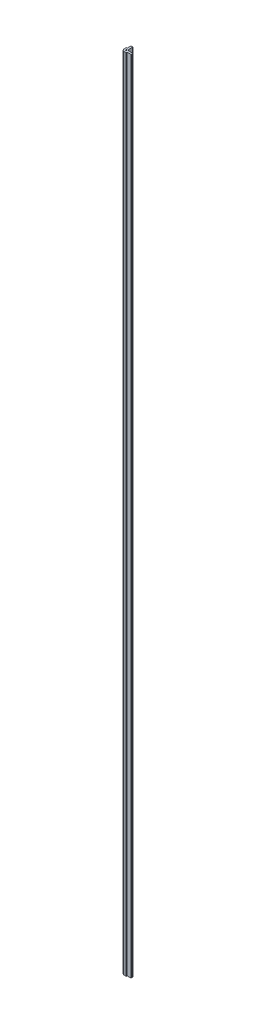
ISO-10303-21;
HEADER;
FILE_DESCRIPTION(('STEP AP214'),'2;1');
FILE_NAME('part.step','',(''),(''),'','','');
FILE_SCHEMA(('AUTOMOTIVE_DESIGN { 1 0 10303 214 1 1 1 1 }'));
ENDSEC;
DATA;
#1=APPLICATION_CONTEXT('core data for automotive mechanical design processes');
#2=APPLICATION_PROTOCOL_DEFINITION('international standard','automotive_design',2000,#1);
#3=PRODUCT_CONTEXT('',#1,'mechanical');
#4=PRODUCT('Part','Part','',(#3));
#5=PRODUCT_RELATED_PRODUCT_CATEGORY('part','',(#4));
#6=PRODUCT_DEFINITION_FORMATION('','',#4);
#7=PRODUCT_DEFINITION_CONTEXT('part definition',#1,'design');
#8=PRODUCT_DEFINITION('design','',#6,#7);
#9=PRODUCT_DEFINITION_SHAPE('','',#8);
#10=(LENGTH_UNIT() NAMED_UNIT(*) SI_UNIT(.MILLI.,.METRE.));
#11=(NAMED_UNIT(*) PLANE_ANGLE_UNIT() SI_UNIT($,.RADIAN.));
#12=(NAMED_UNIT(*) SI_UNIT($,.STERADIAN.) SOLID_ANGLE_UNIT());
#13=UNCERTAINTY_MEASURE_WITH_UNIT(LENGTH_MEASURE(1.E-05),#10,'distance_accuracy_value','');
#14=(GEOMETRIC_REPRESENTATION_CONTEXT(3) GLOBAL_UNCERTAINTY_ASSIGNED_CONTEXT((#13)) GLOBAL_UNIT_ASSIGNED_CONTEXT((#10,
#11,#12)) REPRESENTATION_CONTEXT('',''));
#15=CARTESIAN_POINT('',(0.,0.,0.));
#16=DIRECTION('',(0.,0.,1.));
#17=DIRECTION('',(1.,0.,0.));
#18=AXIS2_PLACEMENT_3D('',#15,#16,#17);
#19=CARTESIAN_POINT('',(0.508,1828.8,-13.208));
#20=DIRECTION('',(0.,-1.,0.));
#21=DIRECTION('',(0.,0.,-1.));
#22=AXIS2_PLACEMENT_3D('',#19,#20,#21);
#23=CYLINDRICAL_SURFACE('',#22,0.762000000000001);
#24=CARTESIAN_POINT('',(0.508,0.,-13.208));
#25=DIRECTION('',(0.,1.,0.));
#26=DIRECTION('',(0.,0.,1.));
#27=AXIS2_PLACEMENT_3D('',#24,#25,#26);
#28=CIRCLE('',#27,0.762000000000001);
#29=CARTESIAN_POINT('',(1.27,0.,-13.208));
#30=VERTEX_POINT('',#29);
#31=CARTESIAN_POINT('',(0.508,0.,-13.97));
#32=VERTEX_POINT('',#31);
#33=EDGE_CURVE('E215',#30,#32,#28,.T.);
#34=ORIENTED_EDGE('',*,*,#33,.T.);
#35=DIRECTION('',(0.,-1.,0.));
#36=VECTOR('',#35,1.);
#37=CARTESIAN_POINT('',(0.508,1828.8,-13.97));
#38=LINE('',#37,#36);
#39=CARTESIAN_POINT('',(0.508,1828.8,-13.97));
#40=VERTEX_POINT('',#39);
#41=EDGE_CURVE('E11',#40,#32,#38,.T.);
#42=ORIENTED_EDGE('',*,*,#41,.F.);
#43=CARTESIAN_POINT('',(0.508,1828.8,-13.208));
#44=DIRECTION('',(0.,1.,0.));
#45=DIRECTION('',(0.,0.,1.));
#46=AXIS2_PLACEMENT_3D('',#43,#44,#45);
#47=CIRCLE('',#46,0.762000000000001);
#48=CARTESIAN_POINT('',(1.27,1828.8,-13.208));
#49=VERTEX_POINT('',#48);
#50=EDGE_CURVE('E258',#49,#40,#47,.T.);
#51=ORIENTED_EDGE('',*,*,#50,.F.);
#52=DIRECTION('',(0.,-1.,0.));
#53=VECTOR('',#52,1.);
#54=CARTESIAN_POINT('',(1.27,1828.8,-13.208));
#55=LINE('',#54,#53);
#56=EDGE_CURVE('E211',#49,#30,#55,.T.);
#57=ORIENTED_EDGE('',*,*,#56,.T.);
#58=EDGE_LOOP('',(#34,#42,#51,#57));
#59=FACE_BOUND('',#58,.T.);
#60=ADVANCED_FACE('F35',(#59),#23,.T.);
#61=CARTESIAN_POINT('',(-2.286,1828.8,-13.97));
#62=DIRECTION('',(0.,0.,1.));
#63=DIRECTION('',(1.,0.,0.));
#64=AXIS2_PLACEMENT_3D('',#61,#62,#63);
#65=PLANE('',#64);
#66=DIRECTION('',(-1.,0.,0.));
#67=VECTOR('',#66,1.);
#68=CARTESIAN_POINT('',(-2.286,0.,-13.97));
#69=LINE('',#68,#67);
#70=CARTESIAN_POINT('',(-2.286,0.,-13.97));
#71=VERTEX_POINT('',#70);
#72=EDGE_CURVE('E218',#32,#71,#69,.T.);
#73=ORIENTED_EDGE('',*,*,#72,.T.);
#74=DIRECTION('',(0.,-1.,0.));
#75=VECTOR('',#74,1.);
#76=CARTESIAN_POINT('',(-2.286,1828.8,-13.97));
#77=LINE('',#76,#75);
#78=CARTESIAN_POINT('',(-2.286,1828.8,-13.97));
#79=VERTEX_POINT('',#78);
#80=EDGE_CURVE('E43',#79,#71,#77,.T.);
#81=ORIENTED_EDGE('',*,*,#80,.F.);
#82=DIRECTION('',(-1.,0.,0.));
#83=VECTOR('',#82,1.);
#84=CARTESIAN_POINT('',(-2.286,1828.8,-13.97));
#85=LINE('',#84,#83);
#86=EDGE_CURVE('E136',#40,#79,#85,.T.);
#87=ORIENTED_EDGE('',*,*,#86,.F.);
#88=ORIENTED_EDGE('',*,*,#41,.T.);
#89=EDGE_LOOP('',(#73,#81,#87,#88));
#90=FACE_BOUND('',#89,.T.);
#91=ADVANCED_FACE('F387',(#90),#65,.F.);
#92=CARTESIAN_POINT('',(-2.286,1828.8,-13.208));
#93=DIRECTION('',(0.,-1.,0.));
#94=DIRECTION('',(0.,0.,-1.));
#95=AXIS2_PLACEMENT_3D('',#92,#93,#94);
#96=CYLINDRICAL_SURFACE('',#95,0.762000000000001);
#97=CARTESIAN_POINT('',(-2.286,0.,-13.208));
#98=DIRECTION('',(0.,1.,0.));
#99=DIRECTION('',(0.,0.,-1.));
#100=AXIS2_PLACEMENT_3D('',#97,#98,#99);
#101=CIRCLE('',#100,0.762000000000001);
#102=CARTESIAN_POINT('',(-3.048,0.,-13.208));
#103=VERTEX_POINT('',#102);
#104=EDGE_CURVE('E221',#71,#103,#101,.T.);
#105=ORIENTED_EDGE('',*,*,#104,.T.);
#106=DIRECTION('',(0.,-1.,0.));
#107=VECTOR('',#106,1.);
#108=CARTESIAN_POINT('',(-3.048,1828.8,-13.208));
#109=LINE('',#108,#107);
#110=CARTESIAN_POINT('',(-3.048,1828.8,-13.208));
#111=VERTEX_POINT('',#110);
#112=EDGE_CURVE('E307',#111,#103,#109,.T.);
#113=ORIENTED_EDGE('',*,*,#112,.F.);
#114=CARTESIAN_POINT('',(-2.286,1828.8,-13.208));
#115=DIRECTION('',(0.,1.,0.));
#116=DIRECTION('',(0.,0.,-1.));
#117=AXIS2_PLACEMENT_3D('',#114,#115,#116);
#118=CIRCLE('',#117,0.762000000000001);
#119=EDGE_CURVE('E315',#79,#111,#118,.T.);
#120=ORIENTED_EDGE('',*,*,#119,.F.);
#121=ORIENTED_EDGE('',*,*,#80,.T.);
#122=EDGE_LOOP('',(#105,#113,#120,#121));
#123=FACE_BOUND('',#122,.T.);
#124=ADVANCED_FACE('F313',(#123),#96,.T.);
#125=CARTESIAN_POINT('',(-3.048,1828.8,-13.208));
#126=DIRECTION('',(1.,0.,0.));
#127=DIRECTION('',(0.,0.,-1.));
#128=AXIS2_PLACEMENT_3D('',#125,#126,#127);
#129=PLANE('',#128);
#130=DIRECTION('',(0.,0.,1.));
#131=VECTOR('',#130,1.);
#132=CARTESIAN_POINT('',(-3.048,0.,-13.208));
#133=LINE('',#132,#131);
#134=CARTESIAN_POINT('',(-3.048,0.,-4.953));
#135=VERTEX_POINT('',#134);
#136=EDGE_CURVE('E223',#103,#135,#133,.T.);
#137=ORIENTED_EDGE('',*,*,#136,.T.);
#138=DIRECTION('',(0.,-1.,0.));
#139=VECTOR('',#138,1.);
#140=CARTESIAN_POINT('',(-3.048,1828.8,-4.953));
#141=LINE('',#140,#139);
#142=CARTESIAN_POINT('',(-3.048,1828.8,-4.953));
#143=VERTEX_POINT('',#142);
#144=EDGE_CURVE('E304',#143,#135,#141,.T.);
#145=ORIENTED_EDGE('',*,*,#144,.F.);
#146=DIRECTION('',(0.,0.,1.));
#147=VECTOR('',#146,1.);
#148=CARTESIAN_POINT('',(-3.048,1828.8,-13.208));
#149=LINE('',#148,#147);
#150=EDGE_CURVE('E333',#111,#143,#149,.T.);
#151=ORIENTED_EDGE('',*,*,#150,.F.);
#152=ORIENTED_EDGE('',*,*,#112,.T.);
#153=EDGE_LOOP('',(#137,#145,#151,#152));
#154=FACE_BOUND('',#153,.T.);
#155=ADVANCED_FACE('F324',(#154),#129,.F.);
#156=CARTESIAN_POINT('',(-3.175,1828.8,-4.953));
#157=DIRECTION('',(0.,-1.,0.));
#158=DIRECTION('',(0.,0.,-1.));
#159=AXIS2_PLACEMENT_3D('',#156,#157,#158);
#160=CYLINDRICAL_SURFACE('',#159,0.127);
#161=CARTESIAN_POINT('',(-3.175,0.,-4.953));
#162=DIRECTION('',(0.,-1.,0.));
#163=DIRECTION('',(0.,0.,-1.));
#164=AXIS2_PLACEMENT_3D('',#161,#162,#163);
#165=CIRCLE('',#164,0.127);
#166=CARTESIAN_POINT('',(-3.175,0.,-4.826));
#167=VERTEX_POINT('',#166);
#168=EDGE_CURVE('E225',#135,#167,#165,.T.);
#169=ORIENTED_EDGE('',*,*,#168,.T.);
#170=DIRECTION('',(0.,-1.,0.));
#171=VECTOR('',#170,1.);
#172=CARTESIAN_POINT('',(-3.175,1828.8,-4.826));
#173=LINE('',#172,#171);
#174=CARTESIAN_POINT('',(-3.175,1828.8,-4.826));
#175=VERTEX_POINT('',#174);
#176=EDGE_CURVE('E301',#175,#167,#173,.T.);
#177=ORIENTED_EDGE('',*,*,#176,.F.);
#178=CARTESIAN_POINT('',(-3.175,1828.8,-4.953));
#179=DIRECTION('',(0.,-1.,0.));
#180=DIRECTION('',(0.,0.,-1.));
#181=AXIS2_PLACEMENT_3D('',#178,#179,#180);
#182=CIRCLE('',#181,0.127);
#183=EDGE_CURVE('E330',#143,#175,#182,.T.);
#184=ORIENTED_EDGE('',*,*,#183,.F.);
#185=ORIENTED_EDGE('',*,*,#144,.T.);
#186=EDGE_LOOP('',(#169,#177,#184,#185));
#187=FACE_BOUND('',#186,.T.);
#188=ADVANCED_FACE('F328',(#187),#160,.F.);
#189=CARTESIAN_POINT('',(-3.175,1828.8,-4.826));
#190=DIRECTION('',(0.,0.,1.));
#191=DIRECTION('',(1.,0.,0.));
#192=AXIS2_PLACEMENT_3D('',#189,#190,#191);
#193=PLANE('',#192);
#194=DIRECTION('',(-1.,0.,0.));
#195=VECTOR('',#194,1.);
#196=CARTESIAN_POINT('',(-3.175,0.,-4.826));
#197=LINE('',#196,#195);
#198=CARTESIAN_POINT('',(-4.826,0.,-4.826));
#199=VERTEX_POINT('',#198);
#200=EDGE_CURVE('E227',#167,#199,#197,.T.);
#201=ORIENTED_EDGE('',*,*,#200,.T.);
#202=DIRECTION('',(0.,-1.,0.));
#203=VECTOR('',#202,1.);
#204=CARTESIAN_POINT('',(-4.826,1828.8,-4.826));
#205=LINE('',#204,#203);
#206=CARTESIAN_POINT('',(-4.826,1828.8,-4.826));
#207=VERTEX_POINT('',#206);
#208=EDGE_CURVE('E298',#207,#199,#205,.T.);
#209=ORIENTED_EDGE('',*,*,#208,.F.);
#210=DIRECTION('',(-1.,0.,0.));
#211=VECTOR('',#210,1.);
#212=CARTESIAN_POINT('',(-3.175,1828.8,-4.826));
#213=LINE('',#212,#211);
#214=EDGE_CURVE('E332',#175,#207,#213,.T.);
#215=ORIENTED_EDGE('',*,*,#214,.F.);
#216=ORIENTED_EDGE('',*,*,#176,.T.);
#217=EDGE_LOOP('',(#201,#209,#215,#216));
#218=FACE_BOUND('',#217,.T.);
#219=ADVANCED_FACE('F400',(#218),#193,.F.);
#220=CARTESIAN_POINT('',(-4.826,1828.8,-4.572));
#221=DIRECTION('',(0.,-1.,0.));
#222=DIRECTION('',(0.,0.,-1.));
#223=AXIS2_PLACEMENT_3D('',#220,#221,#222);
#224=CYLINDRICAL_SURFACE('',#223,0.253999999999999);
#225=CARTESIAN_POINT('',(-4.826,0.,-4.572));
#226=DIRECTION('',(0.,1.,0.));
#227=DIRECTION('',(0.,0.,1.));
#228=AXIS2_PLACEMENT_3D('',#225,#226,#227);
#229=CIRCLE('',#228,0.253999999999999);
#230=CARTESIAN_POINT('',(-5.08,0.,-4.572));
#231=VERTEX_POINT('',#230);
#232=EDGE_CURVE('E229',#199,#231,#229,.T.);
#233=ORIENTED_EDGE('',*,*,#232,.T.);
#234=DIRECTION('',(0.,-1.,0.));
#235=VECTOR('',#234,1.);
#236=CARTESIAN_POINT('',(-5.08,1828.8,-4.572));
#237=LINE('',#236,#235);
#238=CARTESIAN_POINT('',(-5.08,1828.8,-4.572));
#239=VERTEX_POINT('',#238);
#240=EDGE_CURVE('E295',#239,#231,#237,.T.);
#241=ORIENTED_EDGE('',*,*,#240,.F.);
#242=CARTESIAN_POINT('',(-4.826,1828.8,-4.572));
#243=DIRECTION('',(0.,1.,0.));
#244=DIRECTION('',(0.,0.,1.));
#245=AXIS2_PLACEMENT_3D('',#242,#243,#244);
#246=CIRCLE('',#245,0.253999999999999);
#247=EDGE_CURVE('E335',#207,#239,#246,.T.);
#248=ORIENTED_EDGE('',*,*,#247,.F.);
#249=ORIENTED_EDGE('',*,*,#208,.T.);
#250=EDGE_LOOP('',(#233,#241,#248,#249));
#251=FACE_BOUND('',#250,.T.);
#252=ADVANCED_FACE('F403',(#251),#224,.T.);
#253=CARTESIAN_POINT('',(-5.08,1828.8,0.));
#254=DIRECTION('',(1.,0.,0.));
#255=DIRECTION('',(0.,0.,-1.));
#256=AXIS2_PLACEMENT_3D('',#253,#254,#255);
#257=PLANE('',#256);
#258=DIRECTION('',(0.,0.,1.));
#259=VECTOR('',#258,1.);
#260=CARTESIAN_POINT('',(-5.08,0.,0.));
#261=LINE('',#260,#259);
#262=CARTESIAN_POINT('',(-5.08,0.,0.));
#263=VERTEX_POINT('',#262);
#264=EDGE_CURVE('E231',#231,#263,#261,.T.);
#265=ORIENTED_EDGE('',*,*,#264,.T.);
#266=DIRECTION('',(0.,-1.,0.));
#267=VECTOR('',#266,1.);
#268=CARTESIAN_POINT('',(-5.08,1828.8,0.));
#269=LINE('',#268,#267);
#270=CARTESIAN_POINT('',(-5.08,1828.8,0.));
#271=VERTEX_POINT('',#270);
#272=EDGE_CURVE('E292',#271,#263,#269,.T.);
#273=ORIENTED_EDGE('',*,*,#272,.F.);
#274=DIRECTION('',(0.,0.,1.));
#275=VECTOR('',#274,1.);
#276=CARTESIAN_POINT('',(-5.08,1828.8,0.));
#277=LINE('',#276,#275);
#278=EDGE_CURVE('E341',#239,#271,#277,.T.);
#279=ORIENTED_EDGE('',*,*,#278,.F.);
#280=ORIENTED_EDGE('',*,*,#240,.T.);
#281=EDGE_LOOP('',(#265,#273,#279,#280));
#282=FACE_BOUND('',#281,.T.);
#283=ADVANCED_FACE('F407',(#282),#257,.F.);
#284=CARTESIAN_POINT('',(0.,1828.8,0.));
#285=DIRECTION('',(0.,-1.,0.));
#286=DIRECTION('',(0.,0.,-1.));
#287=AXIS2_PLACEMENT_3D('',#284,#285,#286);
#288=CYLINDRICAL_SURFACE('',#287,5.08);
#289=CARTESIAN_POINT('',(0.,0.,0.));
#290=DIRECTION('',(0.,1.,0.));
#291=DIRECTION('',(0.,0.,-1.));
#292=AXIS2_PLACEMENT_3D('',#289,#290,#291);
#293=CIRCLE('',#292,5.08);
#294=CARTESIAN_POINT('',(0.,0.,5.08));
#295=VERTEX_POINT('',#294);
#296=EDGE_CURVE('E233',#263,#295,#293,.T.);
#297=ORIENTED_EDGE('',*,*,#296,.T.);
#298=DIRECTION('',(0.,-1.,0.));
#299=VECTOR('',#298,1.);
#300=CARTESIAN_POINT('',(0.,1828.8,5.08));
#301=LINE('',#300,#299);
#302=CARTESIAN_POINT('',(0.,1828.8,5.08));
#303=VERTEX_POINT('',#302);
#304=EDGE_CURVE('E289',#303,#295,#301,.T.);
#305=ORIENTED_EDGE('',*,*,#304,.F.);
#306=CARTESIAN_POINT('',(0.,1828.8,0.));
#307=DIRECTION('',(0.,1.,0.));
#308=DIRECTION('',(0.,0.,-1.));
#309=AXIS2_PLACEMENT_3D('',#306,#307,#308);
#310=CIRCLE('',#309,5.08);
#311=EDGE_CURVE('E343',#271,#303,#310,.T.);
#312=ORIENTED_EDGE('',*,*,#311,.F.);
#313=ORIENTED_EDGE('',*,*,#272,.T.);
#314=EDGE_LOOP('',(#297,#305,#312,#313));
#315=FACE_BOUND('',#314,.T.);
#316=ADVANCED_FACE('F411',(#315),#288,.T.);
#317=CARTESIAN_POINT('',(0.,1828.8,5.08));
#318=DIRECTION('',(0.,0.,-1.));
#319=DIRECTION('',(-1.,0.,0.));
#320=AXIS2_PLACEMENT_3D('',#317,#318,#319);
#321=PLANE('',#320);
#322=DIRECTION('',(1.,0.,0.));
#323=VECTOR('',#322,1.);
#324=CARTESIAN_POINT('',(0.,0.,5.08));
#325=LINE('',#324,#323);
#326=CARTESIAN_POINT('',(4.572,0.,5.08));
#327=VERTEX_POINT('',#326);
#328=EDGE_CURVE('E235',#295,#327,#325,.T.);
#329=ORIENTED_EDGE('',*,*,#328,.T.);
#330=DIRECTION('',(0.,-1.,0.));
#331=VECTOR('',#330,1.);
#332=CARTESIAN_POINT('',(4.572,1828.8,5.08));
#333=LINE('',#332,#331);
#334=CARTESIAN_POINT('',(4.572,1828.8,5.08));
#335=VERTEX_POINT('',#334);
#336=EDGE_CURVE('E286',#335,#327,#333,.T.);
#337=ORIENTED_EDGE('',*,*,#336,.F.);
#338=DIRECTION('',(1.,0.,0.));
#339=VECTOR('',#338,1.);
#340=CARTESIAN_POINT('',(0.,1828.8,5.08));
#341=LINE('',#340,#339);
#342=EDGE_CURVE('E345',#303,#335,#341,.T.);
#343=ORIENTED_EDGE('',*,*,#342,.F.);
#344=ORIENTED_EDGE('',*,*,#304,.T.);
#345=EDGE_LOOP('',(#329,#337,#343,#344));
#346=FACE_BOUND('',#345,.T.);
#347=ADVANCED_FACE('F415',(#346),#321,.F.);
#348=CARTESIAN_POINT('',(4.572,1828.8,4.826));
#349=DIRECTION('',(0.,-1.,0.));
#350=DIRECTION('',(0.,0.,-1.));
#351=AXIS2_PLACEMENT_3D('',#348,#349,#350);
#352=CYLINDRICAL_SURFACE('',#351,0.254);
#353=CARTESIAN_POINT('',(4.572,0.,4.826));
#354=DIRECTION('',(0.,1.,0.));
#355=DIRECTION('',(0.,0.,-1.));
#356=AXIS2_PLACEMENT_3D('',#353,#354,#355);
#357=CIRCLE('',#356,0.254);
#358=CARTESIAN_POINT('',(4.826,0.,4.826));
#359=VERTEX_POINT('',#358);
#360=EDGE_CURVE('E237',#327,#359,#357,.T.);
#361=ORIENTED_EDGE('',*,*,#360,.T.);
#362=DIRECTION('',(0.,-1.,0.));
#363=VECTOR('',#362,1.);
#364=CARTESIAN_POINT('',(4.826,1828.8,4.826));
#365=LINE('',#364,#363);
#366=CARTESIAN_POINT('',(4.826,1828.8,4.826));
#367=VERTEX_POINT('',#366);
#368=EDGE_CURVE('E283',#367,#359,#365,.T.);
#369=ORIENTED_EDGE('',*,*,#368,.F.);
#370=CARTESIAN_POINT('',(4.572,1828.8,4.826));
#371=DIRECTION('',(0.,1.,0.));
#372=DIRECTION('',(0.,0.,-1.));
#373=AXIS2_PLACEMENT_3D('',#370,#371,#372);
#374=CIRCLE('',#373,0.254);
#375=EDGE_CURVE('E347',#335,#367,#374,.T.);
#376=ORIENTED_EDGE('',*,*,#375,.F.);
#377=ORIENTED_EDGE('',*,*,#336,.T.);
#378=EDGE_LOOP('',(#361,#369,#376,#377));
#379=FACE_BOUND('',#378,.T.);
#380=ADVANCED_FACE('F419',(#379),#352,.T.);
#381=CARTESIAN_POINT('',(4.826,1828.8,3.175));
#382=DIRECTION('',(-1.,0.,0.));
#383=DIRECTION('',(0.,0.,1.));
#384=AXIS2_PLACEMENT_3D('',#381,#382,#383);
#385=PLANE('',#384);
#386=DIRECTION('',(0.,0.,-1.));
#387=VECTOR('',#386,1.);
#388=CARTESIAN_POINT('',(4.826,0.,3.175));
#389=LINE('',#388,#387);
#390=CARTESIAN_POINT('',(4.826,0.,3.175));
#391=VERTEX_POINT('',#390);
#392=EDGE_CURVE('E239',#359,#391,#389,.T.);
#393=ORIENTED_EDGE('',*,*,#392,.T.);
#394=DIRECTION('',(0.,-1.,0.));
#395=VECTOR('',#394,1.);
#396=CARTESIAN_POINT('',(4.826,1828.8,3.175));
#397=LINE('',#396,#395);
#398=CARTESIAN_POINT('',(4.826,1828.8,3.175));
#399=VERTEX_POINT('',#398);
#400=EDGE_CURVE('E280',#399,#391,#397,.T.);
#401=ORIENTED_EDGE('',*,*,#400,.F.);
#402=DIRECTION('',(0.,0.,-1.));
#403=VECTOR('',#402,1.);
#404=CARTESIAN_POINT('',(4.826,1828.8,3.175));
#405=LINE('',#404,#403);
#406=EDGE_CURVE('E349',#367,#399,#405,.T.);
#407=ORIENTED_EDGE('',*,*,#406,.F.);
#408=ORIENTED_EDGE('',*,*,#368,.T.);
#409=EDGE_LOOP('',(#393,#401,#407,#408));
#410=FACE_BOUND('',#409,.T.);
#411=ADVANCED_FACE('F423',(#410),#385,.F.);
#412=CARTESIAN_POINT('',(4.953,1828.8,3.175));
#413=DIRECTION('',(0.,-1.,0.));
#414=DIRECTION('',(0.,0.,-1.));
#415=AXIS2_PLACEMENT_3D('',#412,#413,#414);
#416=CYLINDRICAL_SURFACE('',#415,0.127000000000001);
#417=CARTESIAN_POINT('',(4.953,0.,3.175));
#418=DIRECTION('',(0.,-1.,0.));
#419=DIRECTION('',(0.,0.,1.));
#420=AXIS2_PLACEMENT_3D('',#417,#418,#419);
#421=CIRCLE('',#420,0.127000000000001);
#422=CARTESIAN_POINT('',(4.953,0.,3.048));
#423=VERTEX_POINT('',#422);
#424=EDGE_CURVE('E241',#391,#423,#421,.T.);
#425=ORIENTED_EDGE('',*,*,#424,.T.);
#426=DIRECTION('',(0.,-1.,0.));
#427=VECTOR('',#426,1.);
#428=CARTESIAN_POINT('',(4.953,1828.8,3.048));
#429=LINE('',#428,#427);
#430=CARTESIAN_POINT('',(4.953,1828.8,3.048));
#431=VERTEX_POINT('',#430);
#432=EDGE_CURVE('E277',#431,#423,#429,.T.);
#433=ORIENTED_EDGE('',*,*,#432,.F.);
#434=CARTESIAN_POINT('',(4.953,1828.8,3.175));
#435=DIRECTION('',(0.,-1.,0.));
#436=DIRECTION('',(0.,0.,1.));
#437=AXIS2_PLACEMENT_3D('',#434,#435,#436);
#438=CIRCLE('',#437,0.127000000000001);
#439=EDGE_CURVE('E351',#399,#431,#438,.T.);
#440=ORIENTED_EDGE('',*,*,#439,.F.);
#441=ORIENTED_EDGE('',*,*,#400,.T.);
#442=EDGE_LOOP('',(#425,#433,#440,#441));
#443=FACE_BOUND('',#442,.T.);
#444=ADVANCED_FACE('F427',(#443),#416,.F.);
#445=CARTESIAN_POINT('',(13.208,1828.8,3.048));
#446=DIRECTION('',(0.,0.,-1.));
#447=DIRECTION('',(-1.,0.,0.));
#448=AXIS2_PLACEMENT_3D('',#445,#446,#447);
#449=PLANE('',#448);
#450=DIRECTION('',(1.,0.,0.));
#451=VECTOR('',#450,1.);
#452=CARTESIAN_POINT('',(13.208,0.,3.048));
#453=LINE('',#452,#451);
#454=CARTESIAN_POINT('',(13.208,0.,3.048));
#455=VERTEX_POINT('',#454);
#456=EDGE_CURVE('E243',#423,#455,#453,.T.);
#457=ORIENTED_EDGE('',*,*,#456,.T.);
#458=DIRECTION('',(0.,-1.,0.));
#459=VECTOR('',#458,1.);
#460=CARTESIAN_POINT('',(13.208,1828.8,3.048));
#461=LINE('',#460,#459);
#462=CARTESIAN_POINT('',(13.208,1828.8,3.048));
#463=VERTEX_POINT('',#462);
#464=EDGE_CURVE('E274',#463,#455,#461,.T.);
#465=ORIENTED_EDGE('',*,*,#464,.F.);
#466=DIRECTION('',(1.,0.,0.));
#467=VECTOR('',#466,1.);
#468=CARTESIAN_POINT('',(13.208,1828.8,3.048));
#469=LINE('',#468,#467);
#470=EDGE_CURVE('E353',#431,#463,#469,.T.);
#471=ORIENTED_EDGE('',*,*,#470,.F.);
#472=ORIENTED_EDGE('',*,*,#432,.T.);
#473=EDGE_LOOP('',(#457,#465,#471,#472));
#474=FACE_BOUND('',#473,.T.);
#475=ADVANCED_FACE('F431',(#474),#449,.F.);
#476=CARTESIAN_POINT('',(13.208,1828.8,2.286));
#477=DIRECTION('',(0.,-1.,0.));
#478=DIRECTION('',(0.,0.,-1.));
#479=AXIS2_PLACEMENT_3D('',#476,#477,#478);
#480=CYLINDRICAL_SURFACE('',#479,0.762000000000001);
#481=CARTESIAN_POINT('',(13.208,0.,2.286));
#482=DIRECTION('',(0.,1.,0.));
#483=DIRECTION('',(0.,0.,1.));
#484=AXIS2_PLACEMENT_3D('',#481,#482,#483);
#485=CIRCLE('',#484,0.762000000000001);
#486=CARTESIAN_POINT('',(13.97,0.,2.286));
#487=VERTEX_POINT('',#486);
#488=EDGE_CURVE('E245',#455,#487,#485,.T.);
#489=ORIENTED_EDGE('',*,*,#488,.T.);
#490=DIRECTION('',(0.,-1.,0.));
#491=VECTOR('',#490,1.);
#492=CARTESIAN_POINT('',(13.97,1828.8,2.286));
#493=LINE('',#492,#491);
#494=CARTESIAN_POINT('',(13.97,1828.8,2.286));
#495=VERTEX_POINT('',#494);
#496=EDGE_CURVE('E271',#495,#487,#493,.T.);
#497=ORIENTED_EDGE('',*,*,#496,.F.);
#498=CARTESIAN_POINT('',(13.208,1828.8,2.286));
#499=DIRECTION('',(0.,1.,0.));
#500=DIRECTION('',(0.,0.,1.));
#501=AXIS2_PLACEMENT_3D('',#498,#499,#500);
#502=CIRCLE('',#501,0.762000000000001);
#503=EDGE_CURVE('E355',#463,#495,#502,.T.);
#504=ORIENTED_EDGE('',*,*,#503,.F.);
#505=ORIENTED_EDGE('',*,*,#464,.T.);
#506=EDGE_LOOP('',(#489,#497,#504,#505));
#507=FACE_BOUND('',#506,.T.);
#508=ADVANCED_FACE('F435',(#507),#480,.T.);
#509=CARTESIAN_POINT('',(13.97,1828.8,2.286));
#510=DIRECTION('',(-1.,0.,0.));
#511=DIRECTION('',(0.,0.,1.));
#512=AXIS2_PLACEMENT_3D('',#509,#510,#511);
#513=PLANE('',#512);
#514=DIRECTION('',(0.,0.,-1.));
#515=VECTOR('',#514,1.);
#516=CARTESIAN_POINT('',(13.97,0.,2.286));
#517=LINE('',#516,#515);
#518=CARTESIAN_POINT('',(13.97,0.,-0.508000000000001));
#519=VERTEX_POINT('',#518);
#520=EDGE_CURVE('E247',#487,#519,#517,.T.);
#521=ORIENTED_EDGE('',*,*,#520,.T.);
#522=DIRECTION('',(0.,-1.,0.));
#523=VECTOR('',#522,1.);
#524=CARTESIAN_POINT('',(13.97,1828.8,-0.508000000000001));
#525=LINE('',#524,#523);
#526=CARTESIAN_POINT('',(13.97,1828.8,-0.508000000000001));
#527=VERTEX_POINT('',#526);
#528=EDGE_CURVE('E268',#527,#519,#525,.T.);
#529=ORIENTED_EDGE('',*,*,#528,.F.);
#530=DIRECTION('',(0.,0.,-1.));
#531=VECTOR('',#530,1.);
#532=CARTESIAN_POINT('',(13.97,1828.8,2.286));
#533=LINE('',#532,#531);
#534=EDGE_CURVE('E357',#495,#527,#533,.T.);
#535=ORIENTED_EDGE('',*,*,#534,.F.);
#536=ORIENTED_EDGE('',*,*,#496,.T.);
#537=EDGE_LOOP('',(#521,#529,#535,#536));
#538=FACE_BOUND('',#537,.T.);
#539=ADVANCED_FACE('F439',(#538),#513,.F.);
#540=CARTESIAN_POINT('',(13.208,1828.8,-0.508000000000001));
#541=DIRECTION('',(0.,-1.,0.));
#542=DIRECTION('',(0.,0.,-1.));
#543=AXIS2_PLACEMENT_3D('',#540,#541,#542);
#544=CYLINDRICAL_SURFACE('',#543,0.762000000000002);
#545=CARTESIAN_POINT('',(13.208,0.,-0.508000000000001));
#546=DIRECTION('',(0.,1.,0.));
#547=DIRECTION('',(0.,0.,-1.));
#548=AXIS2_PLACEMENT_3D('',#545,#546,#547);
#549=CIRCLE('',#548,0.762000000000002);
#550=CARTESIAN_POINT('',(13.208,0.,-1.27));
#551=VERTEX_POINT('',#550);
#552=EDGE_CURVE('E249',#519,#551,#549,.T.);
#553=ORIENTED_EDGE('',*,*,#552,.T.);
#554=DIRECTION('',(0.,-1.,0.));
#555=VECTOR('',#554,1.);
#556=CARTESIAN_POINT('',(13.208,1828.8,-1.27));
#557=LINE('',#556,#555);
#558=CARTESIAN_POINT('',(13.208,1828.8,-1.27));
#559=VERTEX_POINT('',#558);
#560=EDGE_CURVE('E265',#559,#551,#557,.T.);
#561=ORIENTED_EDGE('',*,*,#560,.F.);
#562=CARTESIAN_POINT('',(13.208,1828.8,-0.508000000000001));
#563=DIRECTION('',(0.,1.,0.));
#564=DIRECTION('',(0.,0.,-1.));
#565=AXIS2_PLACEMENT_3D('',#562,#563,#564);
#566=CIRCLE('',#565,0.762000000000002);
#567=EDGE_CURVE('E359',#527,#559,#566,.T.);
#568=ORIENTED_EDGE('',*,*,#567,.F.);
#569=ORIENTED_EDGE('',*,*,#528,.T.);
#570=EDGE_LOOP('',(#553,#561,#568,#569));
#571=FACE_BOUND('',#570,.T.);
#572=ADVANCED_FACE('F443',(#571),#544,.T.);
#573=CARTESIAN_POINT('',(3.7674288314446,1828.8,-1.27));
#574=DIRECTION('',(0.,0.,1.));
#575=DIRECTION('',(1.,0.,0.));
#576=AXIS2_PLACEMENT_3D('',#573,#574,#575);
#577=PLANE('',#576);
#578=DIRECTION('',(-1.,0.,0.));
#579=VECTOR('',#578,1.);
#580=CARTESIAN_POINT('',(3.7674288314446,0.,-1.27));
#581=LINE('',#580,#579);
#582=CARTESIAN_POINT('',(3.7674288314446,0.,-1.27));
#583=VERTEX_POINT('',#582);
#584=EDGE_CURVE('E251',#551,#583,#581,.T.);
#585=ORIENTED_EDGE('',*,*,#584,.T.);
#586=DIRECTION('',(0.,-1.,0.));
#587=VECTOR('',#586,1.);
#588=CARTESIAN_POINT('',(3.7674288314446,1828.8,-1.27));
#589=LINE('',#588,#587);
#590=CARTESIAN_POINT('',(3.7674288314446,1828.8,-1.27));
#591=VERTEX_POINT('',#590);
#592=EDGE_CURVE('E262',#591,#583,#589,.T.);
#593=ORIENTED_EDGE('',*,*,#592,.F.);
#594=DIRECTION('',(-1.,0.,0.));
#595=VECTOR('',#594,1.);
#596=CARTESIAN_POINT('',(3.7674288314446,1828.8,-1.27));
#597=LINE('',#596,#595);
#598=EDGE_CURVE('E361',#559,#591,#597,.T.);
#599=ORIENTED_EDGE('',*,*,#598,.F.);
#600=ORIENTED_EDGE('',*,*,#560,.T.);
#601=EDGE_LOOP('',(#585,#593,#599,#600));
#602=FACE_BOUND('',#601,.T.);
#603=ADVANCED_FACE('F367',(#602),#577,.F.);
#604=CARTESIAN_POINT('',(3.7674288314446,1828.8,-1.524));
#605=DIRECTION('',(0.,-1.,0.));
#606=DIRECTION('',(0.,0.,-1.));
#607=AXIS2_PLACEMENT_3D('',#604,#605,#606);
#608=CYLINDRICAL_SURFACE('',#607,0.254);
#609=CARTESIAN_POINT('',(3.7674288314446,0.,-1.524));
#610=DIRECTION('',(0.,-1.,0.));
#611=DIRECTION('',(0.,0.,1.));
#612=AXIS2_PLACEMENT_3D('',#609,#610,#611);
#613=CIRCLE('',#612,0.254);
#614=CARTESIAN_POINT('',(3.53196452947931,0.,-1.42875));
#615=VERTEX_POINT('',#614);
#616=EDGE_CURVE('E253',#583,#615,#613,.T.);
#617=ORIENTED_EDGE('',*,*,#616,.T.);
#618=DIRECTION('',(0.,-1.,0.));
#619=VECTOR('',#618,1.);
#620=CARTESIAN_POINT('',(3.53196452947931,1828.8,-1.42875));
#621=LINE('',#620,#619);
#622=CARTESIAN_POINT('',(3.53196452947931,1828.8,-1.42875));
#623=VERTEX_POINT('',#622);
#624=EDGE_CURVE('E206',#623,#615,#621,.T.);
#625=ORIENTED_EDGE('',*,*,#624,.F.);
#626=CARTESIAN_POINT('',(3.7674288314446,1828.8,-1.524));
#627=DIRECTION('',(0.,-1.,0.));
#628=DIRECTION('',(0.,0.,1.));
#629=AXIS2_PLACEMENT_3D('',#626,#627,#628);
#630=CIRCLE('',#629,0.254);
#631=EDGE_CURVE('E197',#591,#623,#630,.T.);
#632=ORIENTED_EDGE('',*,*,#631,.F.);
#633=ORIENTED_EDGE('',*,*,#592,.T.);
#634=EDGE_LOOP('',(#617,#625,#632,#633));
#635=FACE_BOUND('',#634,.T.);
#636=ADVANCED_FACE('F371',(#635),#608,.F.);
#637=CARTESIAN_POINT('',(0.,1828.8,0.));
#638=DIRECTION('',(0.,-1.,0.));
#639=DIRECTION('',(0.,0.,-1.));
#640=AXIS2_PLACEMENT_3D('',#637,#638,#639);
#641=CYLINDRICAL_SURFACE('',#640,3.81);
#642=CARTESIAN_POINT('',(0.,0.,0.));
#643=DIRECTION('',(0.,1.,0.));
#644=DIRECTION('',(0.,0.,1.));
#645=AXIS2_PLACEMENT_3D('',#642,#643,#644);
#646=CIRCLE('',#645,3.81);
#647=CARTESIAN_POINT('',(1.42875,0.,-3.53196452947931));
#648=VERTEX_POINT('',#647);
#649=EDGE_CURVE('E205',#615,#648,#646,.T.);
#650=ORIENTED_EDGE('',*,*,#649,.T.);
#651=DIRECTION('',(0.,-1.,0.));
#652=VECTOR('',#651,1.);
#653=CARTESIAN_POINT('',(1.42875,1828.8,-3.53196452947931));
#654=LINE('',#653,#652);
#655=CARTESIAN_POINT('',(1.42875,1828.8,-3.53196452947931));
#656=VERTEX_POINT('',#655);
#657=EDGE_CURVE('E202',#656,#648,#654,.T.);
#658=ORIENTED_EDGE('',*,*,#657,.F.);
#659=CARTESIAN_POINT('',(0.,1828.8,0.));
#660=DIRECTION('',(0.,1.,0.));
#661=DIRECTION('',(0.,0.,1.));
#662=AXIS2_PLACEMENT_3D('',#659,#660,#661);
#663=CIRCLE('',#662,3.81);
#664=EDGE_CURVE('E191',#623,#656,#663,.T.);
#665=ORIENTED_EDGE('',*,*,#664,.F.);
#666=ORIENTED_EDGE('',*,*,#624,.T.);
#667=EDGE_LOOP('',(#650,#658,#665,#666));
#668=FACE_BOUND('',#667,.T.);
#669=ADVANCED_FACE('F203',(#668),#641,.T.);
#670=CARTESIAN_POINT('',(1.524,1828.8,-3.7674288314446));
#671=DIRECTION('',(0.,-1.,0.));
#672=DIRECTION('',(0.,0.,-1.));
#673=AXIS2_PLACEMENT_3D('',#670,#671,#672);
#674=CYLINDRICAL_SURFACE('',#673,0.254);
#675=CARTESIAN_POINT('',(1.524,0.,-3.7674288314446));
#676=DIRECTION('',(0.,-1.,0.));
#677=DIRECTION('',(0.,0.,-1.));
#678=AXIS2_PLACEMENT_3D('',#675,#676,#677);
#679=CIRCLE('',#678,0.254);
#680=CARTESIAN_POINT('',(1.27,0.,-3.7674288314446));
#681=VERTEX_POINT('',#680);
#682=EDGE_CURVE('E122',#648,#681,#679,.T.);
#683=ORIENTED_EDGE('',*,*,#682,.T.);
#684=DIRECTION('',(0.,-1.,0.));
#685=VECTOR('',#684,1.);
#686=CARTESIAN_POINT('',(1.27,1828.8,-3.7674288314446));
#687=LINE('',#686,#685);
#688=CARTESIAN_POINT('',(1.27,1828.8,-3.7674288314446));
#689=VERTEX_POINT('',#688);
#690=EDGE_CURVE('E207',#689,#681,#687,.T.);
#691=ORIENTED_EDGE('',*,*,#690,.F.);
#692=CARTESIAN_POINT('',(1.524,1828.8,-3.7674288314446));
#693=DIRECTION('',(0.,-1.,0.));
#694=DIRECTION('',(0.,0.,-1.));
#695=AXIS2_PLACEMENT_3D('',#692,#693,#694);
#696=CIRCLE('',#695,0.254);
#697=EDGE_CURVE('E195',#656,#689,#696,.T.);
#698=ORIENTED_EDGE('',*,*,#697,.F.);
#699=ORIENTED_EDGE('',*,*,#657,.T.);
#700=EDGE_LOOP('',(#683,#691,#698,#699));
#701=FACE_BOUND('',#700,.T.);
#702=ADVANCED_FACE('F209',(#701),#674,.F.);
#703=CARTESIAN_POINT('',(1.27,1828.8,-13.208));
#704=DIRECTION('',(-1.,0.,0.));
#705=DIRECTION('',(0.,0.,1.));
#706=AXIS2_PLACEMENT_3D('',#703,#704,#705);
#707=PLANE('',#706);
#708=DIRECTION('',(0.,0.,-1.));
#709=VECTOR('',#708,1.);
#710=CARTESIAN_POINT('',(1.27,0.,-13.208));
#711=LINE('',#710,#709);
#712=EDGE_CURVE('E128',#681,#30,#711,.T.);
#713=ORIENTED_EDGE('',*,*,#712,.T.);
#714=ORIENTED_EDGE('',*,*,#56,.F.);
#715=DIRECTION('',(0.,0.,-1.));
#716=VECTOR('',#715,1.);
#717=CARTESIAN_POINT('',(1.27,1828.8,-13.208));
#718=LINE('',#717,#716);
#719=EDGE_CURVE('E51',#689,#49,#718,.T.);
#720=ORIENTED_EDGE('',*,*,#719,.F.);
#721=ORIENTED_EDGE('',*,*,#690,.T.);
#722=EDGE_LOOP('',(#713,#714,#720,#721));
#723=FACE_BOUND('',#722,.T.);
#724=ADVANCED_FACE('F375',(#723),#707,.F.);
#725=CARTESIAN_POINT('',(0.508,1828.8,-13.208));
#726=DIRECTION('',(0.,1.,0.));
#727=DIRECTION('',(0.,0.,1.));
#728=AXIS2_PLACEMENT_3D('',#725,#726,#727);
#729=PLANE('',#728);
#730=CARTESIAN_POINT('',(0.,1828.8,0.));
#731=DIRECTION('',(0.,1.,0.));
#732=DIRECTION('',(0.,0.,1.));
#733=AXIS2_PLACEMENT_3D('',#730,#731,#732);
#734=CIRCLE('',#733,1.39699999999977);
#735=CARTESIAN_POINT('',(0.,1828.8,1.39699999999977));
#736=VERTEX_POINT('',#735);
#737=EDGE_CURVE('E498',#736,#736,#734,.T.);
#738=ORIENTED_EDGE('',*,*,#737,.F.);
#739=EDGE_LOOP('',(#738));
#740=FACE_BOUND('',#739,.T.);
#741=ORIENTED_EDGE('',*,*,#50,.T.);
#742=ORIENTED_EDGE('',*,*,#86,.T.);
#743=ORIENTED_EDGE('',*,*,#119,.T.);
#744=ORIENTED_EDGE('',*,*,#150,.T.);
#745=ORIENTED_EDGE('',*,*,#183,.T.);
#746=ORIENTED_EDGE('',*,*,#214,.T.);
#747=ORIENTED_EDGE('',*,*,#247,.T.);
#748=ORIENTED_EDGE('',*,*,#278,.T.);
#749=ORIENTED_EDGE('',*,*,#311,.T.);
#750=ORIENTED_EDGE('',*,*,#342,.T.);
#751=ORIENTED_EDGE('',*,*,#375,.T.);
#752=ORIENTED_EDGE('',*,*,#406,.T.);
#753=ORIENTED_EDGE('',*,*,#439,.T.);
#754=ORIENTED_EDGE('',*,*,#470,.T.);
#755=ORIENTED_EDGE('',*,*,#503,.T.);
#756=ORIENTED_EDGE('',*,*,#534,.T.);
#757=ORIENTED_EDGE('',*,*,#567,.T.);
#758=ORIENTED_EDGE('',*,*,#598,.T.);
#759=ORIENTED_EDGE('',*,*,#631,.T.);
#760=ORIENTED_EDGE('',*,*,#664,.T.);
#761=ORIENTED_EDGE('',*,*,#697,.T.);
#762=ORIENTED_EDGE('',*,*,#719,.T.);
#763=EDGE_LOOP('',(#741,#742,#743,#744,#745,#746,#747,#748,#749,#750,#751,#752,#753,#754,#755,
#756,#757,#758,#759,#760,#761,#762));
#764=FACE_BOUND('',#763,.T.);
#765=ADVANCED_FACE('F193',(#740,#764),#729,.T.);
#766=CARTESIAN_POINT('',(0.508,0.,-13.208));
#767=DIRECTION('',(0.,1.,0.));
#768=DIRECTION('',(0.,0.,1.));
#769=AXIS2_PLACEMENT_3D('',#766,#767,#768);
#770=PLANE('',#769);
#771=CARTESIAN_POINT('',(0.,0.,0.));
#772=DIRECTION('',(0.,1.,0.));
#773=DIRECTION('',(0.,0.,1.));
#774=AXIS2_PLACEMENT_3D('',#771,#772,#773);
#775=CIRCLE('',#774,1.39699999999955);
#776=CARTESIAN_POINT('',(0.,0.,1.39699999999955));
#777=VERTEX_POINT('',#776);
#778=EDGE_CURVE('E219',#777,#777,#775,.T.);
#779=ORIENTED_EDGE('',*,*,#778,.T.);
#780=EDGE_LOOP('',(#779));
#781=FACE_BOUND('',#780,.T.);
#782=ORIENTED_EDGE('',*,*,#33,.F.);
#783=ORIENTED_EDGE('',*,*,#712,.F.);
#784=ORIENTED_EDGE('',*,*,#682,.F.);
#785=ORIENTED_EDGE('',*,*,#649,.F.);
#786=ORIENTED_EDGE('',*,*,#616,.F.);
#787=ORIENTED_EDGE('',*,*,#584,.F.);
#788=ORIENTED_EDGE('',*,*,#552,.F.);
#789=ORIENTED_EDGE('',*,*,#520,.F.);
#790=ORIENTED_EDGE('',*,*,#488,.F.);
#791=ORIENTED_EDGE('',*,*,#456,.F.);
#792=ORIENTED_EDGE('',*,*,#424,.F.);
#793=ORIENTED_EDGE('',*,*,#392,.F.);
#794=ORIENTED_EDGE('',*,*,#360,.F.);
#795=ORIENTED_EDGE('',*,*,#328,.F.);
#796=ORIENTED_EDGE('',*,*,#296,.F.);
#797=ORIENTED_EDGE('',*,*,#264,.F.);
#798=ORIENTED_EDGE('',*,*,#232,.F.);
#799=ORIENTED_EDGE('',*,*,#200,.F.);
#800=ORIENTED_EDGE('',*,*,#168,.F.);
#801=ORIENTED_EDGE('',*,*,#136,.F.);
#802=ORIENTED_EDGE('',*,*,#104,.F.);
#803=ORIENTED_EDGE('',*,*,#72,.F.);
#804=EDGE_LOOP('',(#782,#783,#784,#785,#786,#787,#788,#789,#790,#791,#792,#793,#794,#795,#796,
#797,#798,#799,#800,#801,#802,#803));
#805=FACE_BOUND('',#804,.T.);
#806=ADVANCED_FACE('F319',(#781,#805),#770,.F.);
#807=CARTESIAN_POINT('',(0.,1828.8,0.));
#808=DIRECTION('',(0.,1.,0.));
#809=DIRECTION('',(0.,0.,1.));
#810=AXIS2_PLACEMENT_3D('',#807,#808,#809);
#811=CYLINDRICAL_SURFACE('',#810,1.39699999999966);
#812=ORIENTED_EDGE('',*,*,#778,.F.);
#813=EDGE_LOOP('',(#812));
#814=FACE_BOUND('',#813,.T.);
#815=ORIENTED_EDGE('',*,*,#737,.T.);
#816=EDGE_LOOP('',(#815));
#817=FACE_BOUND('',#816,.T.);
#818=ADVANCED_FACE('F480',(#814,#817),#811,.F.);
#819=CLOSED_SHELL('',(#60,#91,#124,#155,#188,#219,#252,#283,#316,#347,#380,#411,#444,#475,#508,
#539,#572,#603,#636,#669,#702,#724,#765,#806,#818));
#820=MANIFOLD_SOLID_BREP('B2',#819);
#821=ADVANCED_BREP_SHAPE_REPRESENTATION('',(#18,#820),#14);
#822=SHAPE_DEFINITION_REPRESENTATION(#9,#821);
ENDSEC;
END-ISO-10303-21;
